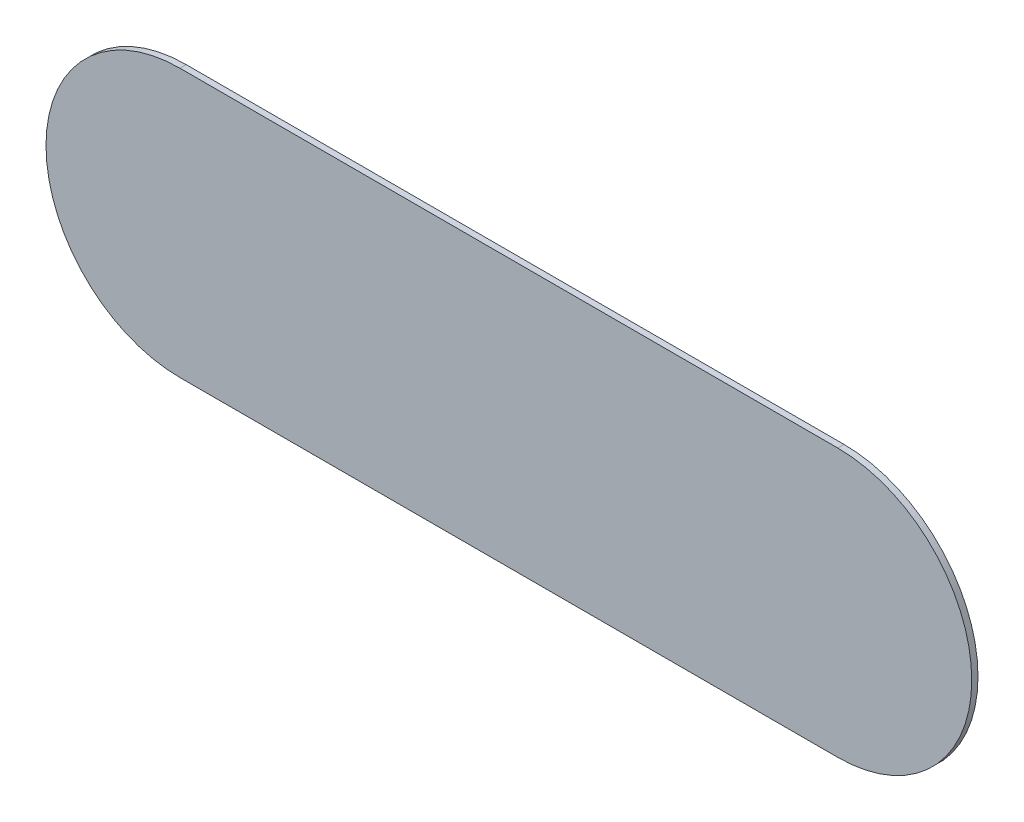
ISO-10303-21;
HEADER;
FILE_DESCRIPTION(('STEP AP214'),'2;1');
FILE_NAME('part.step','',(''),(''),'','','');
FILE_SCHEMA(('AUTOMOTIVE_DESIGN { 1 0 10303 214 1 1 1 1 }'));
ENDSEC;
DATA;
#1=APPLICATION_CONTEXT('core data for automotive mechanical design processes');
#2=APPLICATION_PROTOCOL_DEFINITION('international standard','automotive_design',2000,#1);
#3=PRODUCT_CONTEXT('',#1,'mechanical');
#4=PRODUCT('Part','Part','',(#3));
#5=PRODUCT_RELATED_PRODUCT_CATEGORY('part','',(#4));
#6=PRODUCT_DEFINITION_FORMATION('','',#4);
#7=PRODUCT_DEFINITION_CONTEXT('part definition',#1,'design');
#8=PRODUCT_DEFINITION('design','',#6,#7);
#9=PRODUCT_DEFINITION_SHAPE('','',#8);
#10=(LENGTH_UNIT() NAMED_UNIT(*) SI_UNIT(.MILLI.,.METRE.));
#11=(NAMED_UNIT(*) PLANE_ANGLE_UNIT() SI_UNIT($,.RADIAN.));
#12=(NAMED_UNIT(*) SI_UNIT($,.STERADIAN.) SOLID_ANGLE_UNIT());
#13=UNCERTAINTY_MEASURE_WITH_UNIT(LENGTH_MEASURE(1.E-05),#10,'distance_accuracy_value','');
#14=(GEOMETRIC_REPRESENTATION_CONTEXT(3) GLOBAL_UNCERTAINTY_ASSIGNED_CONTEXT((#13)) GLOBAL_UNIT_ASSIGNED_CONTEXT((#10,
#11,#12)) REPRESENTATION_CONTEXT('',''));
#15=CARTESIAN_POINT('',(0.,0.,0.));
#16=DIRECTION('',(0.,0.,1.));
#17=DIRECTION('',(1.,0.,0.));
#18=AXIS2_PLACEMENT_3D('',#15,#16,#17);
#19=CARTESIAN_POINT('',(126.111,-117.614,0.));
#20=DIRECTION('',(0.,0.,1.));
#21=DIRECTION('',(1.,0.,0.));
#22=AXIS2_PLACEMENT_3D('',#19,#20,#21);
#23=PLANE('',#22);
#24=DIRECTION('',(-1.,0.,0.));
#25=VECTOR('',#24,1.);
#26=CARTESIAN_POINT('',(126.111,-117.614,0.));
#27=LINE('',#26,#25);
#28=CARTESIAN_POINT('',(126.111,-117.614,0.));
#29=VERTEX_POINT('',#28);
#30=CARTESIAN_POINT('',(122.428,-117.614,0.));
#31=VERTEX_POINT('',#30);
#32=EDGE_CURVE('E79',#29,#31,#27,.T.);
#33=ORIENTED_EDGE('',*,*,#32,.T.);
#34=CARTESIAN_POINT('',(122.428,-118.364,0.));
#35=DIRECTION('',(0.,0.,1.));
#36=DIRECTION('',(0.,1.,0.));
#37=AXIS2_PLACEMENT_3D('',#34,#35,#36);
#38=CIRCLE('',#37,0.75);
#39=CARTESIAN_POINT('',(122.428,-119.114,0.));
#40=VERTEX_POINT('',#39);
#41=EDGE_CURVE('E100',#31,#40,#38,.T.);
#42=ORIENTED_EDGE('',*,*,#41,.T.);
#43=DIRECTION('',(1.,0.,0.));
#44=VECTOR('',#43,1.);
#45=CARTESIAN_POINT('',(122.428,-119.114,0.));
#46=LINE('',#45,#44);
#47=CARTESIAN_POINT('',(126.111,-119.114,0.));
#48=VERTEX_POINT('',#47);
#49=EDGE_CURVE('E72',#40,#48,#46,.T.);
#50=ORIENTED_EDGE('',*,*,#49,.T.);
#51=CARTESIAN_POINT('',(126.111,-118.364,0.));
#52=DIRECTION('',(0.,0.,1.));
#53=DIRECTION('',(0.,-1.,0.));
#54=AXIS2_PLACEMENT_3D('',#51,#52,#53);
#55=CIRCLE('',#54,0.75);
#56=EDGE_CURVE('E11',#48,#29,#55,.T.);
#57=ORIENTED_EDGE('',*,*,#56,.T.);
#58=EDGE_LOOP('',(#33,#42,#50,#57));
#59=FACE_BOUND('',#58,.T.);
#60=ADVANCED_FACE('F17',(#59),#23,.T.);
#61=CARTESIAN_POINT('',(126.111,-117.614,-0.035));
#62=DIRECTION('',(0.,0.,1.));
#63=DIRECTION('',(1.,0.,0.));
#64=AXIS2_PLACEMENT_3D('',#61,#62,#63);
#65=PLANE('',#64);
#66=CARTESIAN_POINT('',(126.111,-118.364,-0.035));
#67=DIRECTION('',(0.,0.,1.));
#68=DIRECTION('',(0.,-1.,0.));
#69=AXIS2_PLACEMENT_3D('',#66,#67,#68);
#70=CIRCLE('',#69,0.75);
#71=CARTESIAN_POINT('',(126.111,-119.114,-0.035));
#72=VERTEX_POINT('',#71);
#73=CARTESIAN_POINT('',(126.111,-117.614,-0.035));
#74=VERTEX_POINT('',#73);
#75=EDGE_CURVE('E26',#72,#74,#70,.T.);
#76=ORIENTED_EDGE('',*,*,#75,.F.);
#77=DIRECTION('',(1.,0.,0.));
#78=VECTOR('',#77,1.);
#79=CARTESIAN_POINT('',(122.428,-119.114,-0.035));
#80=LINE('',#79,#78);
#81=CARTESIAN_POINT('',(122.428,-119.114,-0.035));
#82=VERTEX_POINT('',#81);
#83=EDGE_CURVE('E97',#82,#72,#80,.T.);
#84=ORIENTED_EDGE('',*,*,#83,.F.);
#85=CARTESIAN_POINT('',(122.428,-118.364,-0.035));
#86=DIRECTION('',(0.,0.,1.));
#87=DIRECTION('',(0.,1.,0.));
#88=AXIS2_PLACEMENT_3D('',#85,#86,#87);
#89=CIRCLE('',#88,0.75);
#90=CARTESIAN_POINT('',(122.428,-117.614,-0.035));
#91=VERTEX_POINT('',#90);
#92=EDGE_CURVE('E81',#91,#82,#89,.T.);
#93=ORIENTED_EDGE('',*,*,#92,.F.);
#94=DIRECTION('',(-1.,0.,0.));
#95=VECTOR('',#94,1.);
#96=CARTESIAN_POINT('',(126.111,-117.614,-0.035));
#97=LINE('',#96,#95);
#98=EDGE_CURVE('E77',#74,#91,#97,.T.);
#99=ORIENTED_EDGE('',*,*,#98,.F.);
#100=EDGE_LOOP('',(#76,#84,#93,#99));
#101=FACE_BOUND('',#100,.T.);
#102=ADVANCED_FACE('F83',(#101),#65,.F.);
#103=CARTESIAN_POINT('',(126.111,-118.364,-0.035));
#104=DIRECTION('',(0.,0.,-1.));
#105=DIRECTION('',(0.,-1.,0.));
#106=AXIS2_PLACEMENT_3D('',#103,#104,#105);
#107=CYLINDRICAL_SURFACE('',#106,0.75);
#108=ORIENTED_EDGE('',*,*,#75,.T.);
#109=DIRECTION('',(0.,0.,1.));
#110=VECTOR('',#109,1.);
#111=CARTESIAN_POINT('',(126.111,-117.614,-0.035));
#112=LINE('',#111,#110);
#113=EDGE_CURVE('E64',#74,#29,#112,.T.);
#114=ORIENTED_EDGE('',*,*,#113,.T.);
#115=ORIENTED_EDGE('',*,*,#56,.F.);
#116=DIRECTION('',(0.,0.,1.));
#117=VECTOR('',#116,1.);
#118=CARTESIAN_POINT('',(126.111,-119.114,-0.035));
#119=LINE('',#118,#117);
#120=EDGE_CURVE('E67',#72,#48,#119,.T.);
#121=ORIENTED_EDGE('',*,*,#120,.F.);
#122=EDGE_LOOP('',(#108,#114,#115,#121));
#123=FACE_BOUND('',#122,.T.);
#124=ADVANCED_FACE('F63',(#123),#107,.T.);
#125=CARTESIAN_POINT('',(122.428,-119.114,-0.035));
#126=DIRECTION('',(0.,1.,0.));
#127=DIRECTION('',(1.,0.,0.));
#128=AXIS2_PLACEMENT_3D('',#125,#126,#127);
#129=PLANE('',#128);
#130=ORIENTED_EDGE('',*,*,#83,.T.);
#131=ORIENTED_EDGE('',*,*,#120,.T.);
#132=ORIENTED_EDGE('',*,*,#49,.F.);
#133=DIRECTION('',(0.,0.,1.));
#134=VECTOR('',#133,1.);
#135=CARTESIAN_POINT('',(122.428,-119.114,-0.035));
#136=LINE('',#135,#134);
#137=EDGE_CURVE('E103',#82,#40,#136,.T.);
#138=ORIENTED_EDGE('',*,*,#137,.F.);
#139=EDGE_LOOP('',(#130,#131,#132,#138));
#140=FACE_BOUND('',#139,.T.);
#141=ADVANCED_FACE('F118',(#140),#129,.F.);
#142=CARTESIAN_POINT('',(122.428,-118.364,-0.035));
#143=DIRECTION('',(0.,0.,-1.));
#144=DIRECTION('',(0.,1.,0.));
#145=AXIS2_PLACEMENT_3D('',#142,#143,#144);
#146=CYLINDRICAL_SURFACE('',#145,0.75);
#147=ORIENTED_EDGE('',*,*,#92,.T.);
#148=ORIENTED_EDGE('',*,*,#137,.T.);
#149=ORIENTED_EDGE('',*,*,#41,.F.);
#150=DIRECTION('',(0.,0.,1.));
#151=VECTOR('',#150,1.);
#152=CARTESIAN_POINT('',(122.428,-117.614,-0.035));
#153=LINE('',#152,#151);
#154=EDGE_CURVE('E87',#91,#31,#153,.T.);
#155=ORIENTED_EDGE('',*,*,#154,.F.);
#156=EDGE_LOOP('',(#147,#148,#149,#155));
#157=FACE_BOUND('',#156,.T.);
#158=ADVANCED_FACE('F120',(#157),#146,.T.);
#159=CARTESIAN_POINT('',(126.111,-117.614,-0.035));
#160=DIRECTION('',(0.,-1.,0.));
#161=DIRECTION('',(0.,0.,-1.));
#162=AXIS2_PLACEMENT_3D('',#159,#160,#161);
#163=PLANE('',#162);
#164=ORIENTED_EDGE('',*,*,#98,.T.);
#165=ORIENTED_EDGE('',*,*,#154,.T.);
#166=ORIENTED_EDGE('',*,*,#32,.F.);
#167=ORIENTED_EDGE('',*,*,#113,.F.);
#168=EDGE_LOOP('',(#164,#165,#166,#167));
#169=FACE_BOUND('',#168,.T.);
#170=ADVANCED_FACE('F75',(#169),#163,.F.);
#171=CLOSED_SHELL('',(#60,#102,#124,#141,#158,#170));
#172=MANIFOLD_SOLID_BREP('B1',#171);
#173=ADVANCED_BREP_SHAPE_REPRESENTATION('',(#18,#172),#14);
#174=SHAPE_DEFINITION_REPRESENTATION(#9,#173);
ENDSEC;
END-ISO-10303-21;
